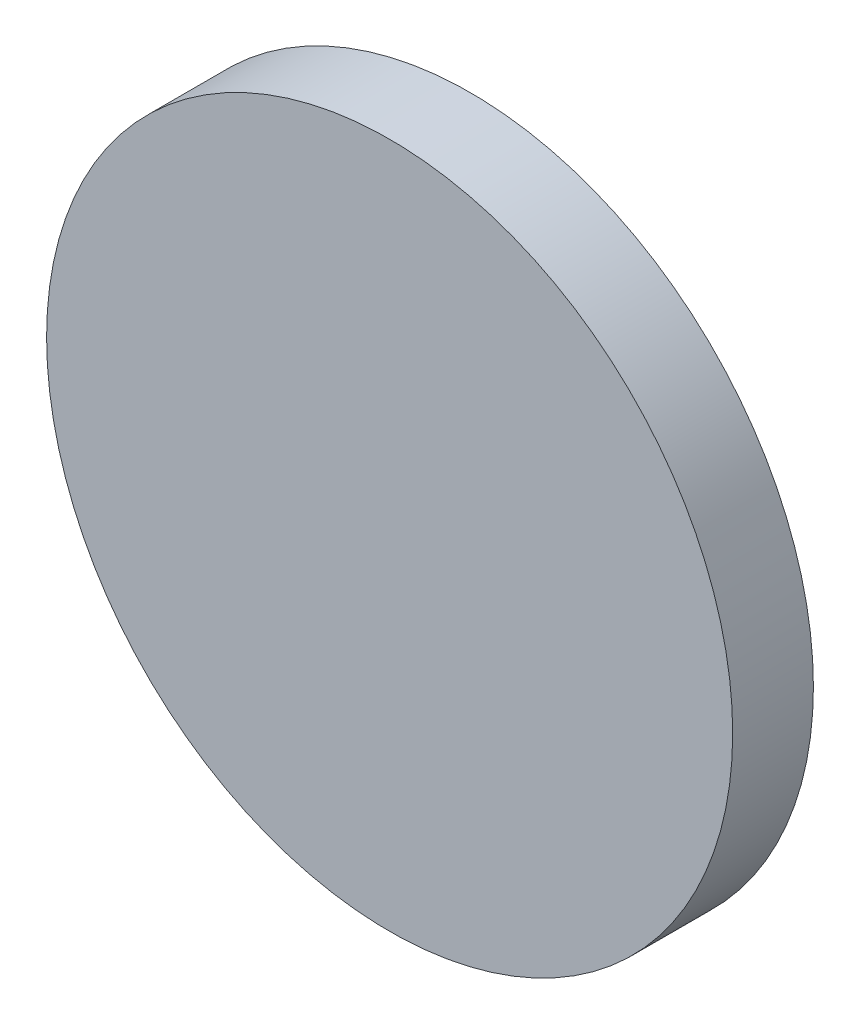
ISO-10303-21;
HEADER;
FILE_DESCRIPTION(('STEP AP214'),'2;1');
FILE_NAME('part.step','',(''),(''),'','','');
FILE_SCHEMA(('AUTOMOTIVE_DESIGN { 1 0 10303 214 1 1 1 1 }'));
ENDSEC;
DATA;
#1=APPLICATION_CONTEXT('core data for automotive mechanical design processes');
#2=APPLICATION_PROTOCOL_DEFINITION('international standard','automotive_design',2000,#1);
#3=PRODUCT_CONTEXT('',#1,'mechanical');
#4=PRODUCT('Part','Part','',(#3));
#5=PRODUCT_RELATED_PRODUCT_CATEGORY('part','',(#4));
#6=PRODUCT_DEFINITION_FORMATION('','',#4);
#7=PRODUCT_DEFINITION_CONTEXT('part definition',#1,'design');
#8=PRODUCT_DEFINITION('design','',#6,#7);
#9=PRODUCT_DEFINITION_SHAPE('','',#8);
#10=(LENGTH_UNIT() NAMED_UNIT(*) SI_UNIT(.MILLI.,.METRE.));
#11=(NAMED_UNIT(*) PLANE_ANGLE_UNIT() SI_UNIT($,.RADIAN.));
#12=(NAMED_UNIT(*) SI_UNIT($,.STERADIAN.) SOLID_ANGLE_UNIT());
#13=UNCERTAINTY_MEASURE_WITH_UNIT(LENGTH_MEASURE(1.E-05),#10,'distance_accuracy_value','');
#14=(GEOMETRIC_REPRESENTATION_CONTEXT(3) GLOBAL_UNCERTAINTY_ASSIGNED_CONTEXT((#13)) GLOBAL_UNIT_ASSIGNED_CONTEXT((#10,
#11,#12)) REPRESENTATION_CONTEXT('',''));
#15=CARTESIAN_POINT('',(0.,0.,0.));
#16=DIRECTION('',(0.,0.,1.));
#17=DIRECTION('',(1.,0.,0.));
#18=AXIS2_PLACEMENT_3D('',#15,#16,#17);
#19=CARTESIAN_POINT('',(0.85000084,0.,0.1999996));
#20=DIRECTION('',(0.,0.,-1.));
#21=DIRECTION('',(0.,-1.,0.));
#22=AXIS2_PLACEMENT_3D('',#19,#20,#21);
#23=PLANE('',#22);
#24=CARTESIAN_POINT('',(0.,0.,0.1999996));
#25=DIRECTION('',(0.,0.,1.));
#26=DIRECTION('',(1.,0.,0.));
#27=AXIS2_PLACEMENT_3D('',#24,#25,#26);
#28=CIRCLE('',#27,0.85000084);
#29=CARTESIAN_POINT('',(-0.85000084,0.,0.1999996));
#30=VERTEX_POINT('',#29);
#31=EDGE_CURVE('E11',#30,#30,#28,.T.);
#32=ORIENTED_EDGE('',*,*,#31,.T.);
#33=EDGE_LOOP('',(#32));
#34=FACE_BOUND('',#33,.T.);
#35=ADVANCED_FACE('F17',(#34),#23,.F.);
#36=CARTESIAN_POINT('',(0.85000084,0.,0.));
#37=DIRECTION('',(0.,0.,-1.));
#38=DIRECTION('',(0.,-1.,0.));
#39=AXIS2_PLACEMENT_3D('',#36,#37,#38);
#40=PLANE('',#39);
#41=CARTESIAN_POINT('',(0.,0.,0.));
#42=DIRECTION('',(0.,0.,1.));
#43=DIRECTION('',(1.,0.,0.));
#44=AXIS2_PLACEMENT_3D('',#41,#42,#43);
#45=CIRCLE('',#44,0.85000084);
#46=CARTESIAN_POINT('',(-0.85000084,0.,0.));
#47=VERTEX_POINT('',#46);
#48=EDGE_CURVE('E42',#47,#47,#45,.T.);
#49=ORIENTED_EDGE('',*,*,#48,.F.);
#50=EDGE_LOOP('',(#49));
#51=FACE_BOUND('',#50,.T.);
#52=ADVANCED_FACE('F61',(#51),#40,.T.);
#53=CARTESIAN_POINT('',(0.,0.,0.));
#54=DIRECTION('',(0.,0.,-1.));
#55=DIRECTION('',(1.,0.,0.));
#56=AXIS2_PLACEMENT_3D('',#53,#54,#55);
#57=CYLINDRICAL_SURFACE('',#56,0.85000084);
#58=ORIENTED_EDGE('',*,*,#48,.T.);
#59=DIRECTION('',(0.,0.,1.));
#60=VECTOR('',#59,1.);
#61=CARTESIAN_POINT('',(-0.85000084,0.,0.));
#62=LINE('',#61,#60);
#63=EDGE_CURVE('E26',#47,#30,#62,.T.);
#64=ORIENTED_EDGE('',*,*,#63,.T.);
#65=ORIENTED_EDGE('',*,*,#31,.F.);
#66=ORIENTED_EDGE('',*,*,#63,.F.);
#67=EDGE_LOOP('',(#58,#64,#65,#66));
#68=FACE_BOUND('',#67,.T.);
#69=ADVANCED_FACE('F40',(#68),#57,.T.);
#70=CLOSED_SHELL('',(#35,#52,#69));
#71=MANIFOLD_SOLID_BREP('B1',#70);
#72=ADVANCED_BREP_SHAPE_REPRESENTATION('',(#18,#71),#14);
#73=SHAPE_DEFINITION_REPRESENTATION(#9,#72);
ENDSEC;
END-ISO-10303-21;
